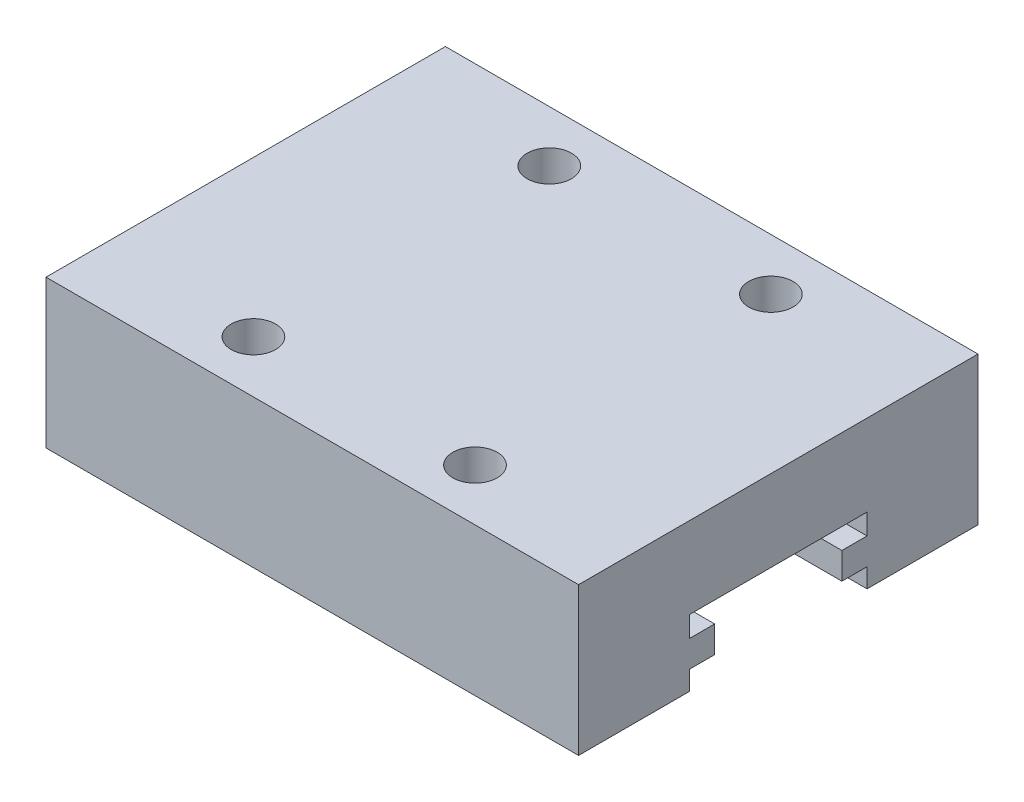
ISO-10303-21;
HEADER;
FILE_DESCRIPTION(('STEP AP214'),'2;1');
FILE_NAME('part.step','',(''),(''),'','','');
FILE_SCHEMA(('AUTOMOTIVE_DESIGN { 1 0 10303 214 1 1 1 1 }'));
ENDSEC;
DATA;
#1=APPLICATION_CONTEXT('core data for automotive mechanical design processes');
#2=APPLICATION_PROTOCOL_DEFINITION('international standard','automotive_design',2000,#1);
#3=PRODUCT_CONTEXT('',#1,'mechanical');
#4=PRODUCT('Part','Part','',(#3));
#5=PRODUCT_RELATED_PRODUCT_CATEGORY('part','',(#4));
#6=PRODUCT_DEFINITION_FORMATION('','',#4);
#7=PRODUCT_DEFINITION_CONTEXT('part definition',#1,'design');
#8=PRODUCT_DEFINITION('design','',#6,#7);
#9=PRODUCT_DEFINITION_SHAPE('','',#8);
#10=(LENGTH_UNIT() NAMED_UNIT(*) SI_UNIT(.MILLI.,.METRE.));
#11=(NAMED_UNIT(*) PLANE_ANGLE_UNIT() SI_UNIT($,.RADIAN.));
#12=(NAMED_UNIT(*) SI_UNIT($,.STERADIAN.) SOLID_ANGLE_UNIT());
#13=UNCERTAINTY_MEASURE_WITH_UNIT(LENGTH_MEASURE(1.E-05),#10,'distance_accuracy_value','');
#14=(GEOMETRIC_REPRESENTATION_CONTEXT(3) GLOBAL_UNCERTAINTY_ASSIGNED_CONTEXT((#13)) GLOBAL_UNIT_ASSIGNED_CONTEXT((#10,
#11,#12)) REPRESENTATION_CONTEXT('',''));
#15=CARTESIAN_POINT('',(0.,0.,0.));
#16=DIRECTION('',(0.,0.,1.));
#17=DIRECTION('',(1.,0.,0.));
#18=AXIS2_PLACEMENT_3D('',#15,#16,#17);
#19=CARTESIAN_POINT('',(0.,0.,0.));
#20=DIRECTION('',(0.,-1.,0.));
#21=DIRECTION('',(0.,0.,-1.));
#22=AXIS2_PLACEMENT_3D('',#19,#20,#21);
#23=PLANE('',#22);
#24=DIRECTION('',(1.,0.,0.));
#25=VECTOR('',#24,1.);
#26=CARTESIAN_POINT('',(-12.8160056179763,0.,-7.5));
#27=LINE('',#26,#25);
#28=CARTESIAN_POINT('',(0.,0.,-7.5));
#29=VERTEX_POINT('',#28);
#30=CARTESIAN_POINT('',(36.,0.,-7.5));
#31=VERTEX_POINT('',#30);
#32=EDGE_CURVE('E184',#29,#31,#27,.T.);
#33=ORIENTED_EDGE('',*,*,#32,.T.);
#34=DIRECTION('',(0.,0.,-1.));
#35=VECTOR('',#34,1.);
#36=CARTESIAN_POINT('',(36.,0.,0.));
#37=LINE('',#36,#35);
#38=CARTESIAN_POINT('',(36.,0.,0.));
#39=VERTEX_POINT('',#38);
#40=EDGE_CURVE('E198',#39,#31,#37,.T.);
#41=ORIENTED_EDGE('',*,*,#40,.F.);
#42=DIRECTION('',(1.,0.,0.));
#43=VECTOR('',#42,1.);
#44=CARTESIAN_POINT('',(0.,0.,0.));
#45=LINE('',#44,#43);
#46=CARTESIAN_POINT('',(0.,0.,0.));
#47=VERTEX_POINT('',#46);
#48=EDGE_CURVE('E212',#47,#39,#45,.T.);
#49=ORIENTED_EDGE('',*,*,#48,.F.);
#50=DIRECTION('',(0.,0.,1.));
#51=VECTOR('',#50,1.);
#52=CARTESIAN_POINT('',(0.,0.,0.));
#53=LINE('',#52,#51);
#54=EDGE_CURVE('E199',#29,#47,#53,.T.);
#55=ORIENTED_EDGE('',*,*,#54,.F.);
#56=EDGE_LOOP('',(#33,#41,#49,#55));
#57=FACE_BOUND('',#56,.T.);
#58=ADVANCED_FACE('F42',(#57),#23,.T.);
#59=CARTESIAN_POINT('',(0.,10.,0.));
#60=DIRECTION('',(1.,0.,0.));
#61=DIRECTION('',(0.,0.,-1.));
#62=AXIS2_PLACEMENT_3D('',#59,#60,#61);
#63=PLANE('',#62);
#64=DIRECTION('',(0.,0.,-1.));
#65=VECTOR('',#64,1.);
#66=CARTESIAN_POINT('',(0.,1.3,-7.5));
#67=LINE('',#66,#65);
#68=CARTESIAN_POINT('',(0.,1.3,-7.5));
#69=VERTEX_POINT('',#68);
#70=CARTESIAN_POINT('',(0.,1.3,-9.2));
#71=VERTEX_POINT('',#70);
#72=EDGE_CURVE('E333',#69,#71,#67,.T.);
#73=ORIENTED_EDGE('',*,*,#72,.F.);
#74=DIRECTION('',(0.,1.,0.));
#75=VECTOR('',#74,1.);
#76=CARTESIAN_POINT('',(0.,0.,-7.5));
#77=LINE('',#76,#75);
#78=EDGE_CURVE('E270',#29,#69,#77,.T.);
#79=ORIENTED_EDGE('',*,*,#78,.F.);
#80=ORIENTED_EDGE('',*,*,#54,.T.);
#81=DIRECTION('',(0.,-1.,0.));
#82=VECTOR('',#81,1.);
#83=CARTESIAN_POINT('',(0.,10.,0.));
#84=LINE('',#83,#82);
#85=CARTESIAN_POINT('',(0.,10.,0.));
#86=VERTEX_POINT('',#85);
#87=EDGE_CURVE('E11',#86,#47,#84,.T.);
#88=ORIENTED_EDGE('',*,*,#87,.F.);
#89=DIRECTION('',(0.,0.,1.));
#90=VECTOR('',#89,1.);
#91=CARTESIAN_POINT('',(0.,10.,0.));
#92=LINE('',#91,#90);
#93=CARTESIAN_POINT('',(0.,10.,-27.));
#94=VERTEX_POINT('',#93);
#95=EDGE_CURVE('E210',#94,#86,#92,.T.);
#96=ORIENTED_EDGE('',*,*,#95,.F.);
#97=DIRECTION('',(0.,-1.,0.));
#98=VECTOR('',#97,1.);
#99=CARTESIAN_POINT('',(0.,10.,-27.));
#100=LINE('',#99,#98);
#101=CARTESIAN_POINT('',(0.,0.,-27.));
#102=VERTEX_POINT('',#101);
#103=EDGE_CURVE('E216',#94,#102,#100,.T.);
#104=ORIENTED_EDGE('',*,*,#103,.T.);
#105=CARTESIAN_POINT('',(0.,0.,-19.5));
#106=VERTEX_POINT('',#105);
#107=EDGE_CURVE('E227',#102,#106,#53,.T.);
#108=ORIENTED_EDGE('',*,*,#107,.T.);
#109=DIRECTION('',(0.,-1.,0.));
#110=VECTOR('',#109,1.);
#111=CARTESIAN_POINT('',(0.,0.,-19.5));
#112=LINE('',#111,#110);
#113=CARTESIAN_POINT('',(0.,1.3,-19.5));
#114=VERTEX_POINT('',#113);
#115=EDGE_CURVE('E61',#114,#106,#112,.T.);
#116=ORIENTED_EDGE('',*,*,#115,.F.);
#117=DIRECTION('',(0.,0.,-1.));
#118=VECTOR('',#117,1.);
#119=CARTESIAN_POINT('',(0.,1.3,-19.5));
#120=LINE('',#119,#118);
#121=CARTESIAN_POINT('',(0.,1.3,-17.8));
#122=VERTEX_POINT('',#121);
#123=EDGE_CURVE('E357',#122,#114,#120,.T.);
#124=ORIENTED_EDGE('',*,*,#123,.F.);
#125=DIRECTION('',(0.,-1.,0.));
#126=VECTOR('',#125,1.);
#127=CARTESIAN_POINT('',(0.,3.1,-17.8));
#128=LINE('',#127,#126);
#129=CARTESIAN_POINT('',(0.,3.1,-17.8));
#130=VERTEX_POINT('',#129);
#131=EDGE_CURVE('E354',#130,#122,#128,.T.);
#132=ORIENTED_EDGE('',*,*,#131,.F.);
#133=DIRECTION('',(0.,0.,1.));
#134=VECTOR('',#133,1.);
#135=CARTESIAN_POINT('',(0.,3.1,-19.5));
#136=LINE('',#135,#134);
#137=CARTESIAN_POINT('',(0.,3.1,-19.5));
#138=VERTEX_POINT('',#137);
#139=EDGE_CURVE('E351',#138,#130,#136,.T.);
#140=ORIENTED_EDGE('',*,*,#139,.F.);
#141=DIRECTION('',(0.,-1.,0.));
#142=VECTOR('',#141,1.);
#143=CARTESIAN_POINT('',(0.,3.1,-19.5));
#144=LINE('',#143,#142);
#145=CARTESIAN_POINT('',(0.,4.5,-19.5));
#146=VERTEX_POINT('',#145);
#147=EDGE_CURVE('E348',#146,#138,#144,.T.);
#148=ORIENTED_EDGE('',*,*,#147,.F.);
#149=DIRECTION('',(0.,0.,-1.));
#150=VECTOR('',#149,1.);
#151=CARTESIAN_POINT('',(0.,4.5,-7.5));
#152=LINE('',#151,#150);
#153=CARTESIAN_POINT('',(0.,4.5,-7.5));
#154=VERTEX_POINT('',#153);
#155=EDGE_CURVE('E345',#154,#146,#152,.T.);
#156=ORIENTED_EDGE('',*,*,#155,.F.);
#157=DIRECTION('',(0.,1.,0.));
#158=VECTOR('',#157,1.);
#159=CARTESIAN_POINT('',(0.,3.1,-7.5));
#160=LINE('',#159,#158);
#161=CARTESIAN_POINT('',(0.,3.1,-7.5));
#162=VERTEX_POINT('',#161);
#163=EDGE_CURVE('E342',#162,#154,#160,.T.);
#164=ORIENTED_EDGE('',*,*,#163,.F.);
#165=DIRECTION('',(0.,0.,1.));
#166=VECTOR('',#165,1.);
#167=CARTESIAN_POINT('',(0.,3.1,-7.5));
#168=LINE('',#167,#166);
#169=CARTESIAN_POINT('',(0.,3.1,-9.2));
#170=VERTEX_POINT('',#169);
#171=EDGE_CURVE('E339',#170,#162,#168,.T.);
#172=ORIENTED_EDGE('',*,*,#171,.F.);
#173=DIRECTION('',(0.,1.,0.));
#174=VECTOR('',#173,1.);
#175=CARTESIAN_POINT('',(0.,3.1,-9.2));
#176=LINE('',#175,#174);
#177=EDGE_CURVE('E336',#71,#170,#176,.T.);
#178=ORIENTED_EDGE('',*,*,#177,.F.);
#179=EDGE_LOOP('',(#73,#79,#80,#88,#96,#104,#108,#116,#124,#132,#140,#148,#156,#164,#172,#178));
#180=FACE_BOUND('',#179,.T.);
#181=ADVANCED_FACE('F44',(#180),#63,.F.);
#182=CARTESIAN_POINT('',(0.,10.,0.));
#183=DIRECTION('',(0.,0.,-1.));
#184=DIRECTION('',(-1.,0.,0.));
#185=AXIS2_PLACEMENT_3D('',#182,#183,#184);
#186=PLANE('',#185);
#187=ORIENTED_EDGE('',*,*,#48,.T.);
#188=DIRECTION('',(0.,-1.,0.));
#189=VECTOR('',#188,1.);
#190=CARTESIAN_POINT('',(36.,10.,0.));
#191=LINE('',#190,#189);
#192=CARTESIAN_POINT('',(36.,10.,0.));
#193=VERTEX_POINT('',#192);
#194=EDGE_CURVE('E51',#193,#39,#191,.T.);
#195=ORIENTED_EDGE('',*,*,#194,.F.);
#196=DIRECTION('',(1.,0.,0.));
#197=VECTOR('',#196,1.);
#198=CARTESIAN_POINT('',(0.,10.,0.));
#199=LINE('',#198,#197);
#200=EDGE_CURVE('E103',#86,#193,#199,.T.);
#201=ORIENTED_EDGE('',*,*,#200,.F.);
#202=ORIENTED_EDGE('',*,*,#87,.T.);
#203=EDGE_LOOP('',(#187,#195,#201,#202));
#204=FACE_BOUND('',#203,.T.);
#205=ADVANCED_FACE('F372',(#204),#186,.F.);
#206=CARTESIAN_POINT('',(36.,10.,0.));
#207=DIRECTION('',(-1.,0.,0.));
#208=DIRECTION('',(0.,0.,1.));
#209=AXIS2_PLACEMENT_3D('',#206,#207,#208);
#210=PLANE('',#209);
#211=ORIENTED_EDGE('',*,*,#40,.T.);
#212=DIRECTION('',(0.,-1.,0.));
#213=VECTOR('',#212,1.);
#214=CARTESIAN_POINT('',(36.,0.,-7.5));
#215=LINE('',#214,#213);
#216=CARTESIAN_POINT('',(36.,1.3,-7.5));
#217=VERTEX_POINT('',#216);
#218=EDGE_CURVE('E181',#217,#31,#215,.T.);
#219=ORIENTED_EDGE('',*,*,#218,.F.);
#220=DIRECTION('',(0.,0.,1.));
#221=VECTOR('',#220,1.);
#222=CARTESIAN_POINT('',(36.,1.3,-7.5));
#223=LINE('',#222,#221);
#224=CARTESIAN_POINT('',(36.,1.3,-9.2));
#225=VERTEX_POINT('',#224);
#226=EDGE_CURVE('E202',#225,#217,#223,.T.);
#227=ORIENTED_EDGE('',*,*,#226,.F.);
#228=DIRECTION('',(0.,-1.,0.));
#229=VECTOR('',#228,1.);
#230=CARTESIAN_POINT('',(36.,3.1,-9.2));
#231=LINE('',#230,#229);
#232=CARTESIAN_POINT('',(36.,3.1,-9.2));
#233=VERTEX_POINT('',#232);
#234=EDGE_CURVE('E305',#233,#225,#231,.T.);
#235=ORIENTED_EDGE('',*,*,#234,.F.);
#236=DIRECTION('',(0.,0.,-1.));
#237=VECTOR('',#236,1.);
#238=CARTESIAN_POINT('',(36.,3.1,-7.5));
#239=LINE('',#238,#237);
#240=CARTESIAN_POINT('',(36.,3.1,-7.5));
#241=VERTEX_POINT('',#240);
#242=EDGE_CURVE('E308',#241,#233,#239,.T.);
#243=ORIENTED_EDGE('',*,*,#242,.F.);
#244=DIRECTION('',(0.,-1.,0.));
#245=VECTOR('',#244,1.);
#246=CARTESIAN_POINT('',(36.,3.1,-7.5));
#247=LINE('',#246,#245);
#248=CARTESIAN_POINT('',(36.,4.5,-7.5));
#249=VERTEX_POINT('',#248);
#250=EDGE_CURVE('E311',#249,#241,#247,.T.);
#251=ORIENTED_EDGE('',*,*,#250,.F.);
#252=DIRECTION('',(0.,0.,1.));
#253=VECTOR('',#252,1.);
#254=CARTESIAN_POINT('',(36.,4.5,-7.5));
#255=LINE('',#254,#253);
#256=CARTESIAN_POINT('',(36.,4.5,-19.5));
#257=VERTEX_POINT('',#256);
#258=EDGE_CURVE('E314',#257,#249,#255,.T.);
#259=ORIENTED_EDGE('',*,*,#258,.F.);
#260=DIRECTION('',(0.,1.,0.));
#261=VECTOR('',#260,1.);
#262=CARTESIAN_POINT('',(36.,3.1,-19.5));
#263=LINE('',#262,#261);
#264=CARTESIAN_POINT('',(36.,3.1,-19.5));
#265=VERTEX_POINT('',#264);
#266=EDGE_CURVE('E317',#265,#257,#263,.T.);
#267=ORIENTED_EDGE('',*,*,#266,.F.);
#268=DIRECTION('',(0.,0.,-1.));
#269=VECTOR('',#268,1.);
#270=CARTESIAN_POINT('',(36.,3.1,-19.5));
#271=LINE('',#270,#269);
#272=CARTESIAN_POINT('',(36.,3.1,-17.8));
#273=VERTEX_POINT('',#272);
#274=EDGE_CURVE('E320',#273,#265,#271,.T.);
#275=ORIENTED_EDGE('',*,*,#274,.F.);
#276=DIRECTION('',(0.,1.,0.));
#277=VECTOR('',#276,1.);
#278=CARTESIAN_POINT('',(36.,3.1,-17.8));
#279=LINE('',#278,#277);
#280=CARTESIAN_POINT('',(36.,1.3,-17.8));
#281=VERTEX_POINT('',#280);
#282=EDGE_CURVE('E323',#281,#273,#279,.T.);
#283=ORIENTED_EDGE('',*,*,#282,.F.);
#284=DIRECTION('',(0.,0.,1.));
#285=VECTOR('',#284,1.);
#286=CARTESIAN_POINT('',(36.,1.3,-19.5));
#287=LINE('',#286,#285);
#288=CARTESIAN_POINT('',(36.,1.3,-19.5));
#289=VERTEX_POINT('',#288);
#290=EDGE_CURVE('E326',#289,#281,#287,.T.);
#291=ORIENTED_EDGE('',*,*,#290,.F.);
#292=DIRECTION('',(0.,1.,0.));
#293=VECTOR('',#292,1.);
#294=CARTESIAN_POINT('',(36.,0.,-19.5));
#295=LINE('',#294,#293);
#296=CARTESIAN_POINT('',(36.,0.,-19.5));
#297=VERTEX_POINT('',#296);
#298=EDGE_CURVE('E192',#297,#289,#295,.T.);
#299=ORIENTED_EDGE('',*,*,#298,.F.);
#300=CARTESIAN_POINT('',(36.,0.,-27.));
#301=VERTEX_POINT('',#300);
#302=EDGE_CURVE('E207',#297,#301,#37,.T.);
#303=ORIENTED_EDGE('',*,*,#302,.T.);
#304=DIRECTION('',(0.,-1.,0.));
#305=VECTOR('',#304,1.);
#306=CARTESIAN_POINT('',(36.,10.,-27.));
#307=LINE('',#306,#305);
#308=CARTESIAN_POINT('',(36.,10.,-27.));
#309=VERTEX_POINT('',#308);
#310=EDGE_CURVE('E219',#309,#301,#307,.T.);
#311=ORIENTED_EDGE('',*,*,#310,.F.);
#312=DIRECTION('',(0.,0.,-1.));
#313=VECTOR('',#312,1.);
#314=CARTESIAN_POINT('',(36.,10.,0.));
#315=LINE('',#314,#313);
#316=EDGE_CURVE('E237',#193,#309,#315,.T.);
#317=ORIENTED_EDGE('',*,*,#316,.F.);
#318=ORIENTED_EDGE('',*,*,#194,.T.);
#319=EDGE_LOOP('',(#211,#219,#227,#235,#243,#251,#259,#267,#275,#283,#291,#299,#303,#311,#317,#318));
#320=FACE_BOUND('',#319,.T.);
#321=ADVANCED_FACE('F205',(#320),#210,.F.);
#322=CARTESIAN_POINT('',(0.,10.,-27.));
#323=DIRECTION('',(0.,0.,1.));
#324=DIRECTION('',(1.,0.,0.));
#325=AXIS2_PLACEMENT_3D('',#322,#323,#324);
#326=PLANE('',#325);
#327=DIRECTION('',(-1.,0.,0.));
#328=VECTOR('',#327,1.);
#329=CARTESIAN_POINT('',(0.,0.,-27.));
#330=LINE('',#329,#328);
#331=EDGE_CURVE('E93',#301,#102,#330,.T.);
#332=ORIENTED_EDGE('',*,*,#331,.T.);
#333=ORIENTED_EDGE('',*,*,#103,.F.);
#334=DIRECTION('',(-1.,0.,0.));
#335=VECTOR('',#334,1.);
#336=CARTESIAN_POINT('',(0.,10.,-27.));
#337=LINE('',#336,#335);
#338=EDGE_CURVE('E71',#309,#94,#337,.T.);
#339=ORIENTED_EDGE('',*,*,#338,.F.);
#340=ORIENTED_EDGE('',*,*,#310,.T.);
#341=EDGE_LOOP('',(#332,#333,#339,#340));
#342=FACE_BOUND('',#341,.T.);
#343=ADVANCED_FACE('F221',(#342),#326,.F.);
#344=CARTESIAN_POINT('',(0.,10.,0.));
#345=DIRECTION('',(0.,-1.,0.));
#346=DIRECTION('',(0.,0.,-1.));
#347=AXIS2_PLACEMENT_3D('',#344,#345,#346);
#348=PLANE('',#347);
#349=CARTESIAN_POINT('',(25.4999864669187,10.,-23.5));
#350=DIRECTION('',(0.,1.,0.));
#351=DIRECTION('',(0.,0.,1.));
#352=AXIS2_PLACEMENT_3D('',#349,#350,#351);
#353=CIRCLE('',#352,1.5);
#354=CARTESIAN_POINT('',(25.4999864669187,10.,-22.));
#355=VERTEX_POINT('',#354);
#356=EDGE_CURVE('E260',#355,#355,#353,.T.);
#357=ORIENTED_EDGE('',*,*,#356,.F.);
#358=EDGE_LOOP('',(#357));
#359=FACE_BOUND('',#358,.T.);
#360=CARTESIAN_POINT('',(10.5,10.,-3.52014924954561));
#361=DIRECTION('',(0.,1.,0.));
#362=DIRECTION('',(0.,0.,1.));
#363=AXIS2_PLACEMENT_3D('',#360,#361,#362);
#364=CIRCLE('',#363,1.5);
#365=CARTESIAN_POINT('',(10.5,10.,-2.02014924954561));
#366=VERTEX_POINT('',#365);
#367=EDGE_CURVE('E251',#366,#366,#364,.T.);
#368=ORIENTED_EDGE('',*,*,#367,.F.);
#369=EDGE_LOOP('',(#368));
#370=FACE_BOUND('',#369,.T.);
#371=CARTESIAN_POINT('',(25.4999864669187,10.,-3.5));
#372=DIRECTION('',(0.,1.,0.));
#373=DIRECTION('',(0.,0.,1.));
#374=AXIS2_PLACEMENT_3D('',#371,#372,#373);
#375=CIRCLE('',#374,1.5);
#376=CARTESIAN_POINT('',(25.4999864669187,10.,-2.));
#377=VERTEX_POINT('',#376);
#378=EDGE_CURVE('E266',#377,#377,#375,.T.);
#379=ORIENTED_EDGE('',*,*,#378,.F.);
#380=EDGE_LOOP('',(#379));
#381=FACE_BOUND('',#380,.T.);
#382=CARTESIAN_POINT('',(10.5,10.,-23.5201492495456));
#383=DIRECTION('',(0.,1.,0.));
#384=DIRECTION('',(0.,0.,1.));
#385=AXIS2_PLACEMENT_3D('',#382,#383,#384);
#386=CIRCLE('',#385,1.5);
#387=CARTESIAN_POINT('',(10.5,10.,-22.0201492495456));
#388=VERTEX_POINT('',#387);
#389=EDGE_CURVE('E243',#388,#388,#386,.T.);
#390=ORIENTED_EDGE('',*,*,#389,.F.);
#391=EDGE_LOOP('',(#390));
#392=FACE_BOUND('',#391,.T.);
#393=ORIENTED_EDGE('',*,*,#95,.T.);
#394=ORIENTED_EDGE('',*,*,#200,.T.);
#395=ORIENTED_EDGE('',*,*,#316,.T.);
#396=ORIENTED_EDGE('',*,*,#338,.T.);
#397=EDGE_LOOP('',(#393,#394,#395,#396));
#398=FACE_BOUND('',#397,.T.);
#399=ADVANCED_FACE('F384',(#359,#370,#381,#392,#398),#348,.F.);
#400=DIRECTION('',(1.,0.,0.));
#401=VECTOR('',#400,1.);
#402=CARTESIAN_POINT('',(-12.8160056179763,0.,-19.5));
#403=LINE('',#402,#401);
#404=EDGE_CURVE('E201',#106,#297,#403,.T.);
#405=ORIENTED_EDGE('',*,*,#404,.F.);
#406=ORIENTED_EDGE('',*,*,#107,.F.);
#407=ORIENTED_EDGE('',*,*,#331,.F.);
#408=ORIENTED_EDGE('',*,*,#302,.F.);
#409=EDGE_LOOP('',(#405,#406,#407,#408));
#410=FACE_BOUND('',#409,.T.);
#411=ADVANCED_FACE('F225',(#410),#23,.T.);
#412=CARTESIAN_POINT('',(10.5,5.,-23.5201492495456));
#413=DIRECTION('',(0.,1.,0.));
#414=DIRECTION('',(0.,0.,1.));
#415=AXIS2_PLACEMENT_3D('',#412,#413,#414);
#416=CYLINDRICAL_SURFACE('',#415,1.5);
#417=CARTESIAN_POINT('',(10.5,5.,-23.5201492495456));
#418=DIRECTION('',(0.,1.,0.));
#419=DIRECTION('',(0.,0.,1.));
#420=AXIS2_PLACEMENT_3D('',#417,#418,#419);
#421=CIRCLE('',#420,1.5);
#422=CARTESIAN_POINT('',(10.5,5.,-22.0201492495456));
#423=VERTEX_POINT('',#422);
#424=EDGE_CURVE('E233',#423,#423,#421,.T.);
#425=ORIENTED_EDGE('',*,*,#424,.F.);
#426=EDGE_LOOP('',(#425));
#427=FACE_BOUND('',#426,.T.);
#428=ORIENTED_EDGE('',*,*,#389,.T.);
#429=EDGE_LOOP('',(#428));
#430=FACE_BOUND('',#429,.T.);
#431=ADVANCED_FACE('F383',(#427,#430),#416,.F.);
#432=CARTESIAN_POINT('',(10.5,5.,-23.5201492495456));
#433=DIRECTION('',(0.,1.,0.));
#434=DIRECTION('',(0.,0.,1.));
#435=AXIS2_PLACEMENT_3D('',#432,#433,#434);
#436=PLANE('',#435);
#437=ORIENTED_EDGE('',*,*,#424,.T.);
#438=EDGE_LOOP('',(#437));
#439=FACE_BOUND('',#438,.T.);
#440=ADVANCED_FACE('F389',(#439),#436,.T.);
#441=CARTESIAN_POINT('',(25.4999864669187,5.,-3.5));
#442=DIRECTION('',(0.,1.,0.));
#443=DIRECTION('',(0.,0.,1.));
#444=AXIS2_PLACEMENT_3D('',#441,#442,#443);
#445=CYLINDRICAL_SURFACE('',#444,1.5);
#446=CARTESIAN_POINT('',(25.4999864669187,5.,-3.5));
#447=DIRECTION('',(0.,1.,0.));
#448=DIRECTION('',(0.,0.,1.));
#449=AXIS2_PLACEMENT_3D('',#446,#447,#448);
#450=CIRCLE('',#449,1.5);
#451=CARTESIAN_POINT('',(25.4999864669187,5.,-2.));
#452=VERTEX_POINT('',#451);
#453=EDGE_CURVE('E256',#452,#452,#450,.T.);
#454=ORIENTED_EDGE('',*,*,#453,.F.);
#455=EDGE_LOOP('',(#454));
#456=FACE_BOUND('',#455,.T.);
#457=ORIENTED_EDGE('',*,*,#378,.T.);
#458=EDGE_LOOP('',(#457));
#459=FACE_BOUND('',#458,.T.);
#460=ADVANCED_FACE('F401',(#456,#459),#445,.F.);
#461=CARTESIAN_POINT('',(25.4999864669187,5.,-3.5));
#462=DIRECTION('',(0.,1.,0.));
#463=DIRECTION('',(0.,0.,1.));
#464=AXIS2_PLACEMENT_3D('',#461,#462,#463);
#465=PLANE('',#464);
#466=ORIENTED_EDGE('',*,*,#453,.T.);
#467=EDGE_LOOP('',(#466));
#468=FACE_BOUND('',#467,.T.);
#469=ADVANCED_FACE('F407',(#468),#465,.T.);
#470=CARTESIAN_POINT('',(10.5,5.,-3.52014924954561));
#471=DIRECTION('',(0.,1.,0.));
#472=DIRECTION('',(0.,0.,1.));
#473=AXIS2_PLACEMENT_3D('',#470,#471,#472);
#474=CYLINDRICAL_SURFACE('',#473,1.5);
#475=CARTESIAN_POINT('',(10.5,5.,-3.52014924954561));
#476=DIRECTION('',(0.,1.,0.));
#477=DIRECTION('',(0.,0.,1.));
#478=AXIS2_PLACEMENT_3D('',#475,#476,#477);
#479=CIRCLE('',#478,1.5);
#480=CARTESIAN_POINT('',(10.5,5.,-2.02014924954561));
#481=VERTEX_POINT('',#480);
#482=EDGE_CURVE('E255',#481,#481,#479,.T.);
#483=ORIENTED_EDGE('',*,*,#482,.F.);
#484=EDGE_LOOP('',(#483));
#485=FACE_BOUND('',#484,.T.);
#486=ORIENTED_EDGE('',*,*,#367,.T.);
#487=EDGE_LOOP('',(#486));
#488=FACE_BOUND('',#487,.T.);
#489=ADVANCED_FACE('F403',(#485,#488),#474,.F.);
#490=CARTESIAN_POINT('',(10.5,5.,-3.52014924954561));
#491=DIRECTION('',(0.,1.,0.));
#492=DIRECTION('',(0.,0.,1.));
#493=AXIS2_PLACEMENT_3D('',#490,#491,#492);
#494=PLANE('',#493);
#495=ORIENTED_EDGE('',*,*,#482,.T.);
#496=EDGE_LOOP('',(#495));
#497=FACE_BOUND('',#496,.T.);
#498=ADVANCED_FACE('F406',(#497),#494,.T.);
#499=CARTESIAN_POINT('',(25.4999864669187,5.,-23.5));
#500=DIRECTION('',(0.,1.,0.));
#501=DIRECTION('',(0.,0.,1.));
#502=AXIS2_PLACEMENT_3D('',#499,#500,#501);
#503=CYLINDRICAL_SURFACE('',#502,1.5);
#504=CARTESIAN_POINT('',(25.4999864669187,5.,-23.5));
#505=DIRECTION('',(0.,1.,0.));
#506=DIRECTION('',(0.,0.,1.));
#507=AXIS2_PLACEMENT_3D('',#504,#505,#506);
#508=CIRCLE('',#507,1.5);
#509=CARTESIAN_POINT('',(25.4999864669187,5.,-22.));
#510=VERTEX_POINT('',#509);
#511=EDGE_CURVE('E247',#510,#510,#508,.T.);
#512=ORIENTED_EDGE('',*,*,#511,.F.);
#513=EDGE_LOOP('',(#512));
#514=FACE_BOUND('',#513,.T.);
#515=ORIENTED_EDGE('',*,*,#356,.T.);
#516=EDGE_LOOP('',(#515));
#517=FACE_BOUND('',#516,.T.);
#518=ADVANCED_FACE('F411',(#514,#517),#503,.F.);
#519=CARTESIAN_POINT('',(25.4999864669187,5.,-23.5));
#520=DIRECTION('',(0.,1.,0.));
#521=DIRECTION('',(0.,0.,1.));
#522=AXIS2_PLACEMENT_3D('',#519,#520,#521);
#523=PLANE('',#522);
#524=ORIENTED_EDGE('',*,*,#511,.T.);
#525=EDGE_LOOP('',(#524));
#526=FACE_BOUND('',#525,.T.);
#527=ADVANCED_FACE('F415',(#526),#523,.T.);
#528=CARTESIAN_POINT('',(-12.8160056179763,0.,-7.5));
#529=DIRECTION('',(0.,0.,1.));
#530=DIRECTION('',(0.,-1.,0.));
#531=AXIS2_PLACEMENT_3D('',#528,#529,#530);
#532=PLANE('',#531);
#533=ORIENTED_EDGE('',*,*,#78,.T.);
#534=DIRECTION('',(1.,0.,0.));
#535=VECTOR('',#534,1.);
#536=CARTESIAN_POINT('',(-12.8160056179763,1.3,-7.5));
#537=LINE('',#536,#535);
#538=EDGE_CURVE('E187',#69,#217,#537,.T.);
#539=ORIENTED_EDGE('',*,*,#538,.T.);
#540=ORIENTED_EDGE('',*,*,#218,.T.);
#541=ORIENTED_EDGE('',*,*,#32,.F.);
#542=EDGE_LOOP('',(#533,#539,#540,#541));
#543=FACE_BOUND('',#542,.T.);
#544=ADVANCED_FACE('F183',(#543),#532,.F.);
#545=CARTESIAN_POINT('',(-12.8160056179763,1.3,-7.5));
#546=DIRECTION('',(0.,1.,0.));
#547=DIRECTION('',(0.,0.,1.));
#548=AXIS2_PLACEMENT_3D('',#545,#546,#547);
#549=PLANE('',#548);
#550=ORIENTED_EDGE('',*,*,#72,.T.);
#551=DIRECTION('',(1.,0.,0.));
#552=VECTOR('',#551,1.);
#553=CARTESIAN_POINT('',(-12.8160056179763,1.3,-9.2));
#554=LINE('',#553,#552);
#555=EDGE_CURVE('E299',#71,#225,#554,.T.);
#556=ORIENTED_EDGE('',*,*,#555,.T.);
#557=ORIENTED_EDGE('',*,*,#226,.T.);
#558=ORIENTED_EDGE('',*,*,#538,.F.);
#559=EDGE_LOOP('',(#550,#556,#557,#558));
#560=FACE_BOUND('',#559,.T.);
#561=ADVANCED_FACE('F428',(#560),#549,.F.);
#562=CARTESIAN_POINT('',(-12.8160056179763,3.1,-9.2));
#563=DIRECTION('',(0.,0.,1.));
#564=DIRECTION('',(0.,-1.,0.));
#565=AXIS2_PLACEMENT_3D('',#562,#563,#564);
#566=PLANE('',#565);
#567=ORIENTED_EDGE('',*,*,#177,.T.);
#568=DIRECTION('',(1.,0.,0.));
#569=VECTOR('',#568,1.);
#570=CARTESIAN_POINT('',(-12.8160056179763,3.1,-9.2));
#571=LINE('',#570,#569);
#572=EDGE_CURVE('E296',#170,#233,#571,.T.);
#573=ORIENTED_EDGE('',*,*,#572,.T.);
#574=ORIENTED_EDGE('',*,*,#234,.T.);
#575=ORIENTED_EDGE('',*,*,#555,.F.);
#576=EDGE_LOOP('',(#567,#573,#574,#575));
#577=FACE_BOUND('',#576,.T.);
#578=ADVANCED_FACE('F456',(#577),#566,.F.);
#579=CARTESIAN_POINT('',(-12.8160056179763,3.1,-7.5));
#580=DIRECTION('',(0.,-1.,0.));
#581=DIRECTION('',(0.,0.,-1.));
#582=AXIS2_PLACEMENT_3D('',#579,#580,#581);
#583=PLANE('',#582);
#584=ORIENTED_EDGE('',*,*,#171,.T.);
#585=DIRECTION('',(1.,0.,0.));
#586=VECTOR('',#585,1.);
#587=CARTESIAN_POINT('',(-12.8160056179763,3.1,-7.5));
#588=LINE('',#587,#586);
#589=EDGE_CURVE('E293',#162,#241,#588,.T.);
#590=ORIENTED_EDGE('',*,*,#589,.T.);
#591=ORIENTED_EDGE('',*,*,#242,.T.);
#592=ORIENTED_EDGE('',*,*,#572,.F.);
#593=EDGE_LOOP('',(#584,#590,#591,#592));
#594=FACE_BOUND('',#593,.T.);
#595=ADVANCED_FACE('F452',(#594),#583,.F.);
#596=CARTESIAN_POINT('',(-12.8160056179763,3.1,-7.5));
#597=DIRECTION('',(0.,0.,1.));
#598=DIRECTION('',(0.,-1.,0.));
#599=AXIS2_PLACEMENT_3D('',#596,#597,#598);
#600=PLANE('',#599);
#601=ORIENTED_EDGE('',*,*,#163,.T.);
#602=DIRECTION('',(1.,0.,0.));
#603=VECTOR('',#602,1.);
#604=CARTESIAN_POINT('',(-12.8160056179763,4.5,-7.5));
#605=LINE('',#604,#603);
#606=EDGE_CURVE('E290',#154,#249,#605,.T.);
#607=ORIENTED_EDGE('',*,*,#606,.T.);
#608=ORIENTED_EDGE('',*,*,#250,.T.);
#609=ORIENTED_EDGE('',*,*,#589,.F.);
#610=EDGE_LOOP('',(#601,#607,#608,#609));
#611=FACE_BOUND('',#610,.T.);
#612=ADVANCED_FACE('F448',(#611),#600,.F.);
#613=CARTESIAN_POINT('',(-12.8160056179763,4.5,-7.5));
#614=DIRECTION('',(0.,1.,0.));
#615=DIRECTION('',(0.,0.,1.));
#616=AXIS2_PLACEMENT_3D('',#613,#614,#615);
#617=PLANE('',#616);
#618=ORIENTED_EDGE('',*,*,#155,.T.);
#619=DIRECTION('',(1.,0.,0.));
#620=VECTOR('',#619,1.);
#621=CARTESIAN_POINT('',(-12.8160056179763,4.5,-19.5));
#622=LINE('',#621,#620);
#623=EDGE_CURVE('E287',#146,#257,#622,.T.);
#624=ORIENTED_EDGE('',*,*,#623,.T.);
#625=ORIENTED_EDGE('',*,*,#258,.T.);
#626=ORIENTED_EDGE('',*,*,#606,.F.);
#627=EDGE_LOOP('',(#618,#624,#625,#626));
#628=FACE_BOUND('',#627,.T.);
#629=ADVANCED_FACE('F444',(#628),#617,.F.);
#630=CARTESIAN_POINT('',(-12.8160056179763,3.1,-19.5));
#631=DIRECTION('',(0.,0.,-1.));
#632=DIRECTION('',(0.,1.,0.));
#633=AXIS2_PLACEMENT_3D('',#630,#631,#632);
#634=PLANE('',#633);
#635=ORIENTED_EDGE('',*,*,#147,.T.);
#636=DIRECTION('',(1.,0.,0.));
#637=VECTOR('',#636,1.);
#638=CARTESIAN_POINT('',(-12.8160056179763,3.1,-19.5));
#639=LINE('',#638,#637);
#640=EDGE_CURVE('E284',#138,#265,#639,.T.);
#641=ORIENTED_EDGE('',*,*,#640,.T.);
#642=ORIENTED_EDGE('',*,*,#266,.T.);
#643=ORIENTED_EDGE('',*,*,#623,.F.);
#644=EDGE_LOOP('',(#635,#641,#642,#643));
#645=FACE_BOUND('',#644,.T.);
#646=ADVANCED_FACE('F440',(#645),#634,.F.);
#647=CARTESIAN_POINT('',(-12.8160056179763,3.1,-19.5));
#648=DIRECTION('',(0.,-1.,0.));
#649=DIRECTION('',(0.,0.,-1.));
#650=AXIS2_PLACEMENT_3D('',#647,#648,#649);
#651=PLANE('',#650);
#652=ORIENTED_EDGE('',*,*,#139,.T.);
#653=DIRECTION('',(1.,0.,0.));
#654=VECTOR('',#653,1.);
#655=CARTESIAN_POINT('',(-12.8160056179763,3.1,-17.8));
#656=LINE('',#655,#654);
#657=EDGE_CURVE('E281',#130,#273,#656,.T.);
#658=ORIENTED_EDGE('',*,*,#657,.T.);
#659=ORIENTED_EDGE('',*,*,#274,.T.);
#660=ORIENTED_EDGE('',*,*,#640,.F.);
#661=EDGE_LOOP('',(#652,#658,#659,#660));
#662=FACE_BOUND('',#661,.T.);
#663=ADVANCED_FACE('F436',(#662),#651,.F.);
#664=CARTESIAN_POINT('',(-12.8160056179763,3.1,-17.8));
#665=DIRECTION('',(0.,0.,-1.));
#666=DIRECTION('',(0.,1.,0.));
#667=AXIS2_PLACEMENT_3D('',#664,#665,#666);
#668=PLANE('',#667);
#669=ORIENTED_EDGE('',*,*,#131,.T.);
#670=DIRECTION('',(1.,0.,0.));
#671=VECTOR('',#670,1.);
#672=CARTESIAN_POINT('',(-12.8160056179763,1.3,-17.8));
#673=LINE('',#672,#671);
#674=EDGE_CURVE('E278',#122,#281,#673,.T.);
#675=ORIENTED_EDGE('',*,*,#674,.T.);
#676=ORIENTED_EDGE('',*,*,#282,.T.);
#677=ORIENTED_EDGE('',*,*,#657,.F.);
#678=EDGE_LOOP('',(#669,#675,#676,#677));
#679=FACE_BOUND('',#678,.T.);
#680=ADVANCED_FACE('F433',(#679),#668,.F.);
#681=CARTESIAN_POINT('',(-12.8160056179763,1.3,-19.5));
#682=DIRECTION('',(0.,1.,0.));
#683=DIRECTION('',(0.,0.,1.));
#684=AXIS2_PLACEMENT_3D('',#681,#682,#683);
#685=PLANE('',#684);
#686=ORIENTED_EDGE('',*,*,#123,.T.);
#687=DIRECTION('',(1.,0.,0.));
#688=VECTOR('',#687,1.);
#689=CARTESIAN_POINT('',(-12.8160056179763,1.3,-19.5));
#690=LINE('',#689,#688);
#691=EDGE_CURVE('E275',#114,#289,#690,.T.);
#692=ORIENTED_EDGE('',*,*,#691,.T.);
#693=ORIENTED_EDGE('',*,*,#290,.T.);
#694=ORIENTED_EDGE('',*,*,#674,.F.);
#695=EDGE_LOOP('',(#686,#692,#693,#694));
#696=FACE_BOUND('',#695,.T.);
#697=ADVANCED_FACE('F364',(#696),#685,.F.);
#698=CARTESIAN_POINT('',(-12.8160056179763,0.,-19.5));
#699=DIRECTION('',(0.,0.,-1.));
#700=DIRECTION('',(0.,1.,0.));
#701=AXIS2_PLACEMENT_3D('',#698,#699,#700);
#702=PLANE('',#701);
#703=ORIENTED_EDGE('',*,*,#115,.T.);
#704=ORIENTED_EDGE('',*,*,#404,.T.);
#705=ORIENTED_EDGE('',*,*,#298,.T.);
#706=ORIENTED_EDGE('',*,*,#691,.F.);
#707=EDGE_LOOP('',(#703,#704,#705,#706));
#708=FACE_BOUND('',#707,.T.);
#709=ADVANCED_FACE('F366',(#708),#702,.F.);
#710=CLOSED_SHELL('',(#58,#181,#205,#321,#343,#399,#411,#431,#440,#460,#469,#489,#498,#518,#527,
#544,#561,#578,#595,#612,#629,#646,#663,#680,#697,#709));
#711=MANIFOLD_SOLID_BREP('B2',#710);
#712=ADVANCED_BREP_SHAPE_REPRESENTATION('',(#18,#711),#14);
#713=SHAPE_DEFINITION_REPRESENTATION(#9,#712);
ENDSEC;
END-ISO-10303-21;
